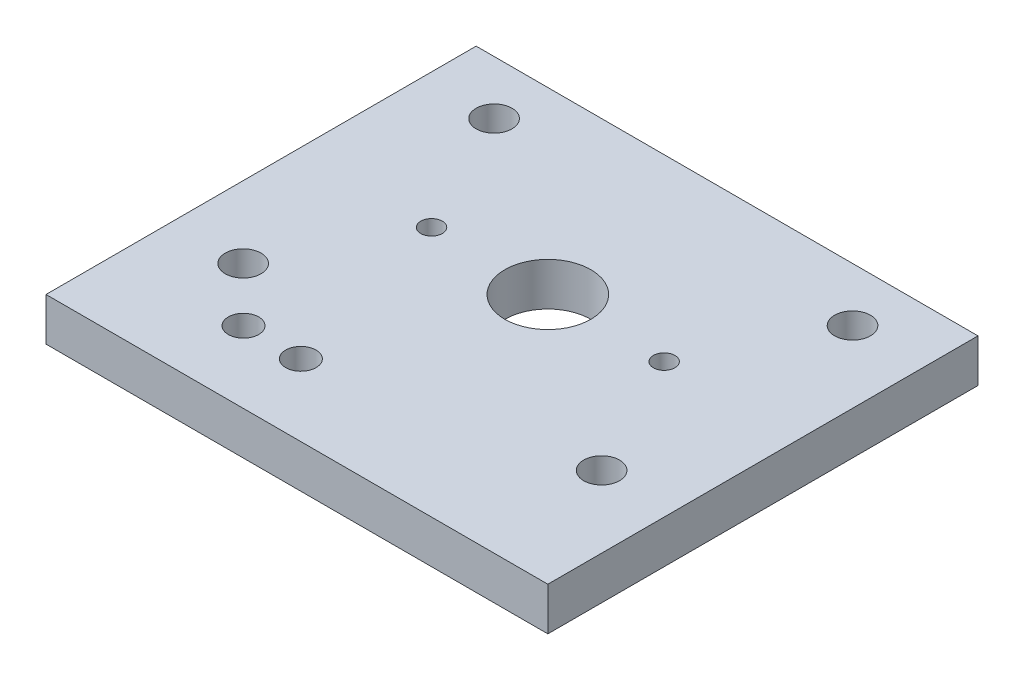
ISO-10303-21;
HEADER;
FILE_DESCRIPTION(('STEP AP214'),'2;1');
FILE_NAME('part.step','',(''),(''),'','','');
FILE_SCHEMA(('AUTOMOTIVE_DESIGN { 1 0 10303 214 1 1 1 1 }'));
ENDSEC;
DATA;
#1=APPLICATION_CONTEXT('core data for automotive mechanical design processes');
#2=APPLICATION_PROTOCOL_DEFINITION('international standard','automotive_design',2000,#1);
#3=PRODUCT_CONTEXT('',#1,'mechanical');
#4=PRODUCT('Part','Part','',(#3));
#5=PRODUCT_RELATED_PRODUCT_CATEGORY('part','',(#4));
#6=PRODUCT_DEFINITION_FORMATION('','',#4);
#7=PRODUCT_DEFINITION_CONTEXT('part definition',#1,'design');
#8=PRODUCT_DEFINITION('design','',#6,#7);
#9=PRODUCT_DEFINITION_SHAPE('','',#8);
#10=(LENGTH_UNIT() NAMED_UNIT(*) SI_UNIT(.MILLI.,.METRE.));
#11=(NAMED_UNIT(*) PLANE_ANGLE_UNIT() SI_UNIT($,.RADIAN.));
#12=(NAMED_UNIT(*) SI_UNIT($,.STERADIAN.) SOLID_ANGLE_UNIT());
#13=UNCERTAINTY_MEASURE_WITH_UNIT(LENGTH_MEASURE(1.E-05),#10,'distance_accuracy_value','');
#14=(GEOMETRIC_REPRESENTATION_CONTEXT(3) GLOBAL_UNCERTAINTY_ASSIGNED_CONTEXT((#13)) GLOBAL_UNIT_ASSIGNED_CONTEXT((#10,
#11,#12)) REPRESENTATION_CONTEXT('',''));
#15=CARTESIAN_POINT('',(0.,0.,0.));
#16=DIRECTION('',(0.,0.,1.));
#17=DIRECTION('',(1.,0.,0.));
#18=AXIS2_PLACEMENT_3D('',#15,#16,#17);
#19=CARTESIAN_POINT('',(0.,6.,35.));
#20=DIRECTION('',(0.,0.,-1.));
#21=DIRECTION('',(-1.,0.,0.));
#22=AXIS2_PLACEMENT_3D('',#19,#20,#21);
#23=PLANE('',#22);
#24=DIRECTION('',(1.,0.,0.));
#25=VECTOR('',#24,1.);
#26=CARTESIAN_POINT('',(0.,0.,35.));
#27=LINE('',#26,#25);
#28=CARTESIAN_POINT('',(-35.,0.,35.));
#29=VERTEX_POINT('',#28);
#30=CARTESIAN_POINT('',(35.,0.,35.));
#31=VERTEX_POINT('',#30);
#32=EDGE_CURVE('E133',#29,#31,#27,.T.);
#33=ORIENTED_EDGE('',*,*,#32,.T.);
#34=DIRECTION('',(0.,-1.,0.));
#35=VECTOR('',#34,1.);
#36=CARTESIAN_POINT('',(35.,6.,35.));
#37=LINE('',#36,#35);
#38=CARTESIAN_POINT('',(35.,6.,35.));
#39=VERTEX_POINT('',#38);
#40=EDGE_CURVE('E11',#39,#31,#37,.T.);
#41=ORIENTED_EDGE('',*,*,#40,.F.);
#42=DIRECTION('',(1.,0.,0.));
#43=VECTOR('',#42,1.);
#44=CARTESIAN_POINT('',(0.,6.,35.));
#45=LINE('',#44,#43);
#46=CARTESIAN_POINT('',(-35.,6.,35.));
#47=VERTEX_POINT('',#46);
#48=EDGE_CURVE('E82',#47,#39,#45,.T.);
#49=ORIENTED_EDGE('',*,*,#48,.F.);
#50=DIRECTION('',(0.,-1.,0.));
#51=VECTOR('',#50,1.);
#52=CARTESIAN_POINT('',(-35.,6.,35.));
#53=LINE('',#52,#51);
#54=EDGE_CURVE('E129',#47,#29,#53,.T.);
#55=ORIENTED_EDGE('',*,*,#54,.T.);
#56=EDGE_LOOP('',(#33,#41,#49,#55));
#57=FACE_BOUND('',#56,.T.);
#58=ADVANCED_FACE('F42',(#57),#23,.F.);
#59=CARTESIAN_POINT('',(35.,6.,0.));
#60=DIRECTION('',(1.,0.,0.));
#61=DIRECTION('',(0.,0.,-1.));
#62=AXIS2_PLACEMENT_3D('',#59,#60,#61);
#63=PLANE('',#62);
#64=DIRECTION('',(0.,0.,1.));
#65=VECTOR('',#64,1.);
#66=CARTESIAN_POINT('',(35.,0.,0.));
#67=LINE('',#66,#65);
#68=CARTESIAN_POINT('',(35.,0.,-25.));
#69=VERTEX_POINT('',#68);
#70=EDGE_CURVE('E91',#69,#31,#67,.T.);
#71=ORIENTED_EDGE('',*,*,#70,.F.);
#72=DIRECTION('',(0.,-1.,0.));
#73=VECTOR('',#72,1.);
#74=CARTESIAN_POINT('',(35.,6.,-25.));
#75=LINE('',#74,#73);
#76=CARTESIAN_POINT('',(35.,6.,-25.));
#77=VERTEX_POINT('',#76);
#78=EDGE_CURVE('E51',#77,#69,#75,.T.);
#79=ORIENTED_EDGE('',*,*,#78,.F.);
#80=DIRECTION('',(0.,0.,1.));
#81=VECTOR('',#80,1.);
#82=CARTESIAN_POINT('',(35.,6.,0.));
#83=LINE('',#82,#81);
#84=EDGE_CURVE('E89',#77,#39,#83,.T.);
#85=ORIENTED_EDGE('',*,*,#84,.T.);
#86=ORIENTED_EDGE('',*,*,#40,.T.);
#87=EDGE_LOOP('',(#71,#79,#85,#86));
#88=FACE_BOUND('',#87,.T.);
#89=ADVANCED_FACE('F88',(#88),#63,.T.);
#90=CARTESIAN_POINT('',(0.,6.,-25.));
#91=DIRECTION('',(0.,0.,-1.));
#92=DIRECTION('',(-1.,0.,0.));
#93=AXIS2_PLACEMENT_3D('',#90,#91,#92);
#94=PLANE('',#93);
#95=DIRECTION('',(1.,0.,0.));
#96=VECTOR('',#95,1.);
#97=CARTESIAN_POINT('',(0.,0.,-25.));
#98=LINE('',#97,#96);
#99=CARTESIAN_POINT('',(-35.,0.,-25.));
#100=VERTEX_POINT('',#99);
#101=EDGE_CURVE('E137',#100,#69,#98,.T.);
#102=ORIENTED_EDGE('',*,*,#101,.F.);
#103=DIRECTION('',(0.,-1.,0.));
#104=VECTOR('',#103,1.);
#105=CARTESIAN_POINT('',(-35.,6.,-25.));
#106=LINE('',#105,#104);
#107=CARTESIAN_POINT('',(-35.,6.,-25.));
#108=VERTEX_POINT('',#107);
#109=EDGE_CURVE('E74',#108,#100,#106,.T.);
#110=ORIENTED_EDGE('',*,*,#109,.F.);
#111=DIRECTION('',(1.,0.,0.));
#112=VECTOR('',#111,1.);
#113=CARTESIAN_POINT('',(0.,6.,-25.));
#114=LINE('',#113,#112);
#115=EDGE_CURVE('E98',#108,#77,#114,.T.);
#116=ORIENTED_EDGE('',*,*,#115,.T.);
#117=ORIENTED_EDGE('',*,*,#78,.T.);
#118=EDGE_LOOP('',(#102,#110,#116,#117));
#119=FACE_BOUND('',#118,.T.);
#120=ADVANCED_FACE('F100',(#119),#94,.T.);
#121=CARTESIAN_POINT('',(25.,6.,17.5));
#122=DIRECTION('',(0.,-1.,0.));
#123=DIRECTION('',(0.,0.,-1.));
#124=AXIS2_PLACEMENT_3D('',#121,#122,#123);
#125=CYLINDRICAL_SURFACE('',#124,2.5);
#126=CARTESIAN_POINT('',(25.,6.,17.5));
#127=DIRECTION('',(0.,1.,0.));
#128=DIRECTION('',(0.,0.,1.));
#129=AXIS2_PLACEMENT_3D('',#126,#127,#128);
#130=CIRCLE('',#129,2.5);
#131=CARTESIAN_POINT('',(25.,6.,20.));
#132=VERTEX_POINT('',#131);
#133=EDGE_CURVE('E123',#132,#132,#130,.T.);
#134=ORIENTED_EDGE('',*,*,#133,.T.);
#135=EDGE_LOOP('',(#134));
#136=FACE_BOUND('',#135,.T.);
#137=CARTESIAN_POINT('',(25.,0.,17.5));
#138=DIRECTION('',(0.,1.,0.));
#139=DIRECTION('',(0.,0.,1.));
#140=AXIS2_PLACEMENT_3D('',#137,#138,#139);
#141=CIRCLE('',#140,2.5);
#142=CARTESIAN_POINT('',(25.,0.,20.));
#143=VERTEX_POINT('',#142);
#144=EDGE_CURVE('E158',#143,#143,#141,.T.);
#145=ORIENTED_EDGE('',*,*,#144,.F.);
#146=EDGE_LOOP('',(#145));
#147=FACE_BOUND('',#146,.T.);
#148=ADVANCED_FACE('F212',(#136,#147),#125,.F.);
#149=CARTESIAN_POINT('',(16.22,6.,0.));
#150=DIRECTION('',(0.,-1.,0.));
#151=DIRECTION('',(0.,0.,-1.));
#152=AXIS2_PLACEMENT_3D('',#149,#150,#151);
#153=CYLINDRICAL_SURFACE('',#152,1.5);
#154=CARTESIAN_POINT('',(16.22,6.,0.));
#155=DIRECTION('',(0.,1.,0.));
#156=DIRECTION('',(0.,0.,1.));
#157=AXIS2_PLACEMENT_3D('',#154,#155,#156);
#158=CIRCLE('',#157,1.5);
#159=CARTESIAN_POINT('',(16.22,6.,1.5));
#160=VERTEX_POINT('',#159);
#161=EDGE_CURVE('E120',#160,#160,#158,.F.);
#162=ORIENTED_EDGE('',*,*,#161,.F.);
#163=EDGE_LOOP('',(#162));
#164=FACE_BOUND('',#163,.T.);
#165=CARTESIAN_POINT('',(16.22,0.,0.));
#166=DIRECTION('',(0.,1.,0.));
#167=DIRECTION('',(0.,0.,1.));
#168=AXIS2_PLACEMENT_3D('',#165,#166,#167);
#169=CIRCLE('',#168,1.5);
#170=CARTESIAN_POINT('',(16.22,0.,1.5));
#171=VERTEX_POINT('',#170);
#172=EDGE_CURVE('E155',#171,#171,#169,.F.);
#173=ORIENTED_EDGE('',*,*,#172,.T.);
#174=EDGE_LOOP('',(#173));
#175=FACE_BOUND('',#174,.T.);
#176=ADVANCED_FACE('F234',(#164,#175),#153,.F.);
#177=CARTESIAN_POINT('',(-16.22,6.,0.));
#178=DIRECTION('',(0.,-1.,0.));
#179=DIRECTION('',(0.,0.,-1.));
#180=AXIS2_PLACEMENT_3D('',#177,#178,#179);
#181=CYLINDRICAL_SURFACE('',#180,1.5);
#182=CARTESIAN_POINT('',(-16.22,6.,0.));
#183=DIRECTION('',(0.,1.,0.));
#184=DIRECTION('',(0.,0.,1.));
#185=AXIS2_PLACEMENT_3D('',#182,#183,#184);
#186=CIRCLE('',#185,1.5);
#187=CARTESIAN_POINT('',(-16.22,6.,1.5));
#188=VERTEX_POINT('',#187);
#189=EDGE_CURVE('E117',#188,#188,#186,.T.);
#190=ORIENTED_EDGE('',*,*,#189,.T.);
#191=EDGE_LOOP('',(#190));
#192=FACE_BOUND('',#191,.T.);
#193=CARTESIAN_POINT('',(-16.22,0.,0.));
#194=DIRECTION('',(0.,1.,0.));
#195=DIRECTION('',(0.,0.,1.));
#196=AXIS2_PLACEMENT_3D('',#193,#194,#195);
#197=CIRCLE('',#196,1.5);
#198=CARTESIAN_POINT('',(-16.22,0.,1.5));
#199=VERTEX_POINT('',#198);
#200=EDGE_CURVE('E152',#199,#199,#197,.T.);
#201=ORIENTED_EDGE('',*,*,#200,.F.);
#202=EDGE_LOOP('',(#201));
#203=FACE_BOUND('',#202,.T.);
#204=ADVANCED_FACE('F230',(#192,#203),#181,.F.);
#205=CARTESIAN_POINT('',(0.,6.,0.));
#206=DIRECTION('',(0.,-1.,0.));
#207=DIRECTION('',(0.,0.,-1.));
#208=AXIS2_PLACEMENT_3D('',#205,#206,#207);
#209=CYLINDRICAL_SURFACE('',#208,6.);
#210=CARTESIAN_POINT('',(0.,6.,0.));
#211=DIRECTION('',(0.,1.,0.));
#212=DIRECTION('',(0.,0.,1.));
#213=AXIS2_PLACEMENT_3D('',#210,#211,#212);
#214=CIRCLE('',#213,6.);
#215=CARTESIAN_POINT('',(0.,6.,6.));
#216=VERTEX_POINT('',#215);
#217=EDGE_CURVE('E114',#216,#216,#214,.T.);
#218=ORIENTED_EDGE('',*,*,#217,.T.);
#219=EDGE_LOOP('',(#218));
#220=FACE_BOUND('',#219,.T.);
#221=CARTESIAN_POINT('',(0.,0.,0.));
#222=DIRECTION('',(0.,1.,0.));
#223=DIRECTION('',(0.,0.,1.));
#224=AXIS2_PLACEMENT_3D('',#221,#222,#223);
#225=CIRCLE('',#224,6.);
#226=CARTESIAN_POINT('',(0.,0.,6.));
#227=VERTEX_POINT('',#226);
#228=EDGE_CURVE('E149',#227,#227,#225,.T.);
#229=ORIENTED_EDGE('',*,*,#228,.F.);
#230=EDGE_LOOP('',(#229));
#231=FACE_BOUND('',#230,.T.);
#232=ADVANCED_FACE('F226',(#220,#231),#209,.F.);
#233=CARTESIAN_POINT('',(-25.,6.,-17.5));
#234=DIRECTION('',(0.,-1.,0.));
#235=DIRECTION('',(0.,0.,-1.));
#236=AXIS2_PLACEMENT_3D('',#233,#234,#235);
#237=CYLINDRICAL_SURFACE('',#236,2.5);
#238=CARTESIAN_POINT('',(-25.,6.,-17.5));
#239=DIRECTION('',(0.,1.,0.));
#240=DIRECTION('',(0.,0.,1.));
#241=AXIS2_PLACEMENT_3D('',#238,#239,#240);
#242=CIRCLE('',#241,2.5);
#243=CARTESIAN_POINT('',(-25.,6.,-15.));
#244=VERTEX_POINT('',#243);
#245=EDGE_CURVE('E111',#244,#244,#242,.T.);
#246=ORIENTED_EDGE('',*,*,#245,.T.);
#247=EDGE_LOOP('',(#246));
#248=FACE_BOUND('',#247,.T.);
#249=CARTESIAN_POINT('',(-25.,0.,-17.5));
#250=DIRECTION('',(0.,1.,0.));
#251=DIRECTION('',(0.,0.,1.));
#252=AXIS2_PLACEMENT_3D('',#249,#250,#251);
#253=CIRCLE('',#252,2.5);
#254=CARTESIAN_POINT('',(-25.,0.,-15.));
#255=VERTEX_POINT('',#254);
#256=EDGE_CURVE('E146',#255,#255,#253,.T.);
#257=ORIENTED_EDGE('',*,*,#256,.F.);
#258=EDGE_LOOP('',(#257));
#259=FACE_BOUND('',#258,.T.);
#260=ADVANCED_FACE('F222',(#248,#259),#237,.F.);
#261=CARTESIAN_POINT('',(25.,6.,-17.5));
#262=DIRECTION('',(0.,-1.,0.));
#263=DIRECTION('',(0.,0.,-1.));
#264=AXIS2_PLACEMENT_3D('',#261,#262,#263);
#265=CYLINDRICAL_SURFACE('',#264,2.5);
#266=CARTESIAN_POINT('',(25.,6.,-17.5));
#267=DIRECTION('',(0.,1.,0.));
#268=DIRECTION('',(0.,0.,1.));
#269=AXIS2_PLACEMENT_3D('',#266,#267,#268);
#270=CIRCLE('',#269,2.5);
#271=CARTESIAN_POINT('',(25.,6.,-15.));
#272=VERTEX_POINT('',#271);
#273=EDGE_CURVE('E108',#272,#272,#270,.F.);
#274=ORIENTED_EDGE('',*,*,#273,.F.);
#275=EDGE_LOOP('',(#274));
#276=FACE_BOUND('',#275,.T.);
#277=CARTESIAN_POINT('',(25.,0.,-17.5));
#278=DIRECTION('',(0.,1.,0.));
#279=DIRECTION('',(0.,0.,1.));
#280=AXIS2_PLACEMENT_3D('',#277,#278,#279);
#281=CIRCLE('',#280,2.5);
#282=CARTESIAN_POINT('',(25.,0.,-15.));
#283=VERTEX_POINT('',#282);
#284=EDGE_CURVE('E143',#283,#283,#281,.F.);
#285=ORIENTED_EDGE('',*,*,#284,.T.);
#286=EDGE_LOOP('',(#285));
#287=FACE_BOUND('',#286,.T.);
#288=ADVANCED_FACE('F218',(#276,#287),#265,.F.);
#289=CARTESIAN_POINT('',(-17.4501096164413,6.,25.));
#290=DIRECTION('',(0.,-1.,0.));
#291=DIRECTION('',(0.,0.,-1.));
#292=AXIS2_PLACEMENT_3D('',#289,#290,#291);
#293=CYLINDRICAL_SURFACE('',#292,2.125);
#294=CARTESIAN_POINT('',(-17.4501096164413,6.,25.));
#295=DIRECTION('',(0.,1.,0.));
#296=DIRECTION('',(0.,0.,1.));
#297=AXIS2_PLACEMENT_3D('',#294,#295,#296);
#298=CIRCLE('',#297,2.125);
#299=CARTESIAN_POINT('',(-17.4501096164413,6.,27.125));
#300=VERTEX_POINT('',#299);
#301=EDGE_CURVE('E102',#300,#300,#298,.T.);
#302=ORIENTED_EDGE('',*,*,#301,.T.);
#303=EDGE_LOOP('',(#302));
#304=FACE_BOUND('',#303,.T.);
#305=CARTESIAN_POINT('',(-17.4501096164413,0.,25.));
#306=DIRECTION('',(0.,1.,0.));
#307=DIRECTION('',(0.,0.,1.));
#308=AXIS2_PLACEMENT_3D('',#305,#306,#307);
#309=CIRCLE('',#308,2.125);
#310=CARTESIAN_POINT('',(-17.4501096164413,0.,27.125));
#311=VERTEX_POINT('',#310);
#312=EDGE_CURVE('E140',#311,#311,#309,.T.);
#313=ORIENTED_EDGE('',*,*,#312,.F.);
#314=EDGE_LOOP('',(#313));
#315=FACE_BOUND('',#314,.T.);
#316=ADVANCED_FACE('F215',(#304,#315),#293,.F.);
#317=CARTESIAN_POINT('',(-35.,6.,0.));
#318=DIRECTION('',(1.,0.,0.));
#319=DIRECTION('',(0.,0.,-1.));
#320=AXIS2_PLACEMENT_3D('',#317,#318,#319);
#321=PLANE('',#320);
#322=DIRECTION('',(0.,0.,1.));
#323=VECTOR('',#322,1.);
#324=CARTESIAN_POINT('',(-35.,0.,0.));
#325=LINE('',#324,#323);
#326=EDGE_CURVE('E77',#100,#29,#325,.T.);
#327=ORIENTED_EDGE('',*,*,#326,.T.);
#328=ORIENTED_EDGE('',*,*,#54,.F.);
#329=DIRECTION('',(0.,0.,1.));
#330=VECTOR('',#329,1.);
#331=CARTESIAN_POINT('',(-35.,6.,0.));
#332=LINE('',#331,#330);
#333=EDGE_CURVE('E59',#108,#47,#332,.T.);
#334=ORIENTED_EDGE('',*,*,#333,.F.);
#335=ORIENTED_EDGE('',*,*,#109,.T.);
#336=EDGE_LOOP('',(#327,#328,#334,#335));
#337=FACE_BOUND('',#336,.T.);
#338=ADVANCED_FACE('F200',(#337),#321,.F.);
#339=CARTESIAN_POINT('',(-9.45010961644133,6.,25.));
#340=DIRECTION('',(0.,-1.,0.));
#341=DIRECTION('',(0.,0.,-1.));
#342=AXIS2_PLACEMENT_3D('',#339,#340,#341);
#343=CYLINDRICAL_SURFACE('',#342,2.125);
#344=CARTESIAN_POINT('',(-9.45010961644133,6.,25.));
#345=DIRECTION('',(0.,1.,0.));
#346=DIRECTION('',(0.,0.,1.));
#347=AXIS2_PLACEMENT_3D('',#344,#345,#346);
#348=CIRCLE('',#347,2.125);
#349=CARTESIAN_POINT('',(-9.45010961644133,6.,27.125));
#350=VERTEX_POINT('',#349);
#351=EDGE_CURVE('E164',#350,#350,#348,.T.);
#352=ORIENTED_EDGE('',*,*,#351,.T.);
#353=EDGE_LOOP('',(#352));
#354=FACE_BOUND('',#353,.T.);
#355=CARTESIAN_POINT('',(-9.45010961644133,0.,25.));
#356=DIRECTION('',(0.,1.,0.));
#357=DIRECTION('',(0.,0.,1.));
#358=AXIS2_PLACEMENT_3D('',#355,#356,#357);
#359=CIRCLE('',#358,2.125);
#360=CARTESIAN_POINT('',(-9.45010961644133,0.,27.125));
#361=VERTEX_POINT('',#360);
#362=EDGE_CURVE('E130',#361,#361,#359,.T.);
#363=ORIENTED_EDGE('',*,*,#362,.F.);
#364=EDGE_LOOP('',(#363));
#365=FACE_BOUND('',#364,.T.);
#366=ADVANCED_FACE('F44',(#354,#365),#343,.F.);
#367=CARTESIAN_POINT('',(-25.,6.,17.5));
#368=DIRECTION('',(0.,-1.,0.));
#369=DIRECTION('',(0.,0.,-1.));
#370=AXIS2_PLACEMENT_3D('',#367,#368,#369);
#371=CYLINDRICAL_SURFACE('',#370,2.5);
#372=CARTESIAN_POINT('',(-25.,6.,17.5));
#373=DIRECTION('',(0.,1.,0.));
#374=DIRECTION('',(0.,0.,1.));
#375=AXIS2_PLACEMENT_3D('',#372,#373,#374);
#376=CIRCLE('',#375,2.5);
#377=CARTESIAN_POINT('',(-25.,6.,20.));
#378=VERTEX_POINT('',#377);
#379=EDGE_CURVE('E126',#378,#378,#376,.F.);
#380=ORIENTED_EDGE('',*,*,#379,.F.);
#381=EDGE_LOOP('',(#380));
#382=FACE_BOUND('',#381,.T.);
#383=CARTESIAN_POINT('',(-25.,0.,17.5));
#384=DIRECTION('',(0.,1.,0.));
#385=DIRECTION('',(0.,0.,1.));
#386=AXIS2_PLACEMENT_3D('',#383,#384,#385);
#387=CIRCLE('',#386,2.5);
#388=CARTESIAN_POINT('',(-25.,0.,20.));
#389=VERTEX_POINT('',#388);
#390=EDGE_CURVE('E161',#389,#389,#387,.F.);
#391=ORIENTED_EDGE('',*,*,#390,.T.);
#392=EDGE_LOOP('',(#391));
#393=FACE_BOUND('',#392,.T.);
#394=ADVANCED_FACE('F190',(#382,#393),#371,.F.);
#395=CARTESIAN_POINT('',(0.,6.,0.));
#396=DIRECTION('',(0.,1.,0.));
#397=DIRECTION('',(0.,0.,1.));
#398=AXIS2_PLACEMENT_3D('',#395,#396,#397);
#399=PLANE('',#398);
#400=ORIENTED_EDGE('',*,*,#351,.F.);
#401=EDGE_LOOP('',(#400));
#402=FACE_BOUND('',#401,.T.);
#403=ORIENTED_EDGE('',*,*,#48,.T.);
#404=ORIENTED_EDGE('',*,*,#84,.F.);
#405=ORIENTED_EDGE('',*,*,#115,.F.);
#406=ORIENTED_EDGE('',*,*,#333,.T.);
#407=EDGE_LOOP('',(#403,#404,#405,#406));
#408=FACE_BOUND('',#407,.T.);
#409=ORIENTED_EDGE('',*,*,#301,.F.);
#410=EDGE_LOOP('',(#409));
#411=FACE_BOUND('',#410,.T.);
#412=ORIENTED_EDGE('',*,*,#273,.T.);
#413=EDGE_LOOP('',(#412));
#414=FACE_BOUND('',#413,.T.);
#415=ORIENTED_EDGE('',*,*,#245,.F.);
#416=EDGE_LOOP('',(#415));
#417=FACE_BOUND('',#416,.T.);
#418=ORIENTED_EDGE('',*,*,#217,.F.);
#419=EDGE_LOOP('',(#418));
#420=FACE_BOUND('',#419,.T.);
#421=ORIENTED_EDGE('',*,*,#189,.F.);
#422=EDGE_LOOP('',(#421));
#423=FACE_BOUND('',#422,.T.);
#424=ORIENTED_EDGE('',*,*,#161,.T.);
#425=EDGE_LOOP('',(#424));
#426=FACE_BOUND('',#425,.T.);
#427=ORIENTED_EDGE('',*,*,#133,.F.);
#428=EDGE_LOOP('',(#427));
#429=FACE_BOUND('',#428,.T.);
#430=ORIENTED_EDGE('',*,*,#379,.T.);
#431=EDGE_LOOP('',(#430));
#432=FACE_BOUND('',#431,.T.);
#433=ADVANCED_FACE('F96',(#402,#408,#411,#414,#417,#420,#423,#426,#429,#432),#399,.T.);
#434=CARTESIAN_POINT('',(0.,0.,0.));
#435=DIRECTION('',(0.,1.,0.));
#436=DIRECTION('',(0.,0.,1.));
#437=AXIS2_PLACEMENT_3D('',#434,#435,#436);
#438=PLANE('',#437);
#439=ORIENTED_EDGE('',*,*,#362,.T.);
#440=EDGE_LOOP('',(#439));
#441=FACE_BOUND('',#440,.T.);
#442=ORIENTED_EDGE('',*,*,#32,.F.);
#443=ORIENTED_EDGE('',*,*,#326,.F.);
#444=ORIENTED_EDGE('',*,*,#101,.T.);
#445=ORIENTED_EDGE('',*,*,#70,.T.);
#446=EDGE_LOOP('',(#442,#443,#444,#445));
#447=FACE_BOUND('',#446,.T.);
#448=ORIENTED_EDGE('',*,*,#312,.T.);
#449=EDGE_LOOP('',(#448));
#450=FACE_BOUND('',#449,.T.);
#451=ORIENTED_EDGE('',*,*,#284,.F.);
#452=EDGE_LOOP('',(#451));
#453=FACE_BOUND('',#452,.T.);
#454=ORIENTED_EDGE('',*,*,#256,.T.);
#455=EDGE_LOOP('',(#454));
#456=FACE_BOUND('',#455,.T.);
#457=ORIENTED_EDGE('',*,*,#228,.T.);
#458=EDGE_LOOP('',(#457));
#459=FACE_BOUND('',#458,.T.);
#460=ORIENTED_EDGE('',*,*,#200,.T.);
#461=EDGE_LOOP('',(#460));
#462=FACE_BOUND('',#461,.T.);
#463=ORIENTED_EDGE('',*,*,#172,.F.);
#464=EDGE_LOOP('',(#463));
#465=FACE_BOUND('',#464,.T.);
#466=ORIENTED_EDGE('',*,*,#144,.T.);
#467=EDGE_LOOP('',(#466));
#468=FACE_BOUND('',#467,.T.);
#469=ORIENTED_EDGE('',*,*,#390,.F.);
#470=EDGE_LOOP('',(#469));
#471=FACE_BOUND('',#470,.T.);
#472=ADVANCED_FACE('F169',(#441,#447,#450,#453,#456,#459,#462,#465,#468,#471),#438,.F.);
#473=CLOSED_SHELL('',(#58,#89,#120,#148,#176,#204,#232,#260,#288,#316,#338,#366,#394,#433,#472));
#474=MANIFOLD_SOLID_BREP('B2',#473);
#475=ADVANCED_BREP_SHAPE_REPRESENTATION('',(#18,#474),#14);
#476=SHAPE_DEFINITION_REPRESENTATION(#9,#475);
ENDSEC;
END-ISO-10303-21;
